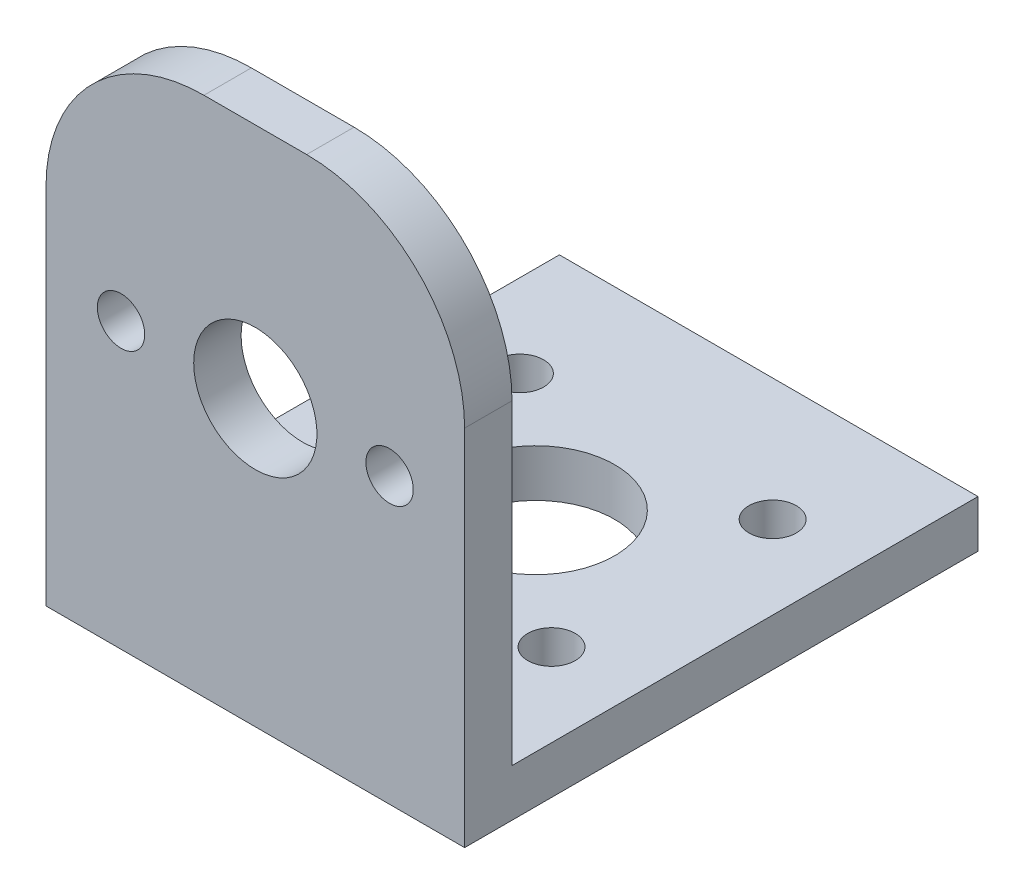
ISO-10303-21;
HEADER;
FILE_DESCRIPTION(('STEP AP214'),'2;1');
FILE_NAME('part.step','',(''),(''),'','','');
FILE_SCHEMA(('AUTOMOTIVE_DESIGN { 1 0 10303 214 1 1 1 1 }'));
ENDSEC;
DATA;
#1=APPLICATION_CONTEXT('core data for automotive mechanical design processes');
#2=APPLICATION_PROTOCOL_DEFINITION('international standard','automotive_design',2000,#1);
#3=PRODUCT_CONTEXT('',#1,'mechanical');
#4=PRODUCT('Part','Part','',(#3));
#5=PRODUCT_RELATED_PRODUCT_CATEGORY('part','',(#4));
#6=PRODUCT_DEFINITION_FORMATION('','',#4);
#7=PRODUCT_DEFINITION_CONTEXT('part definition',#1,'design');
#8=PRODUCT_DEFINITION('design','',#6,#7);
#9=PRODUCT_DEFINITION_SHAPE('','',#8);
#10=(LENGTH_UNIT() NAMED_UNIT(*) SI_UNIT(.MILLI.,.METRE.));
#11=(NAMED_UNIT(*) PLANE_ANGLE_UNIT() SI_UNIT($,.RADIAN.));
#12=(NAMED_UNIT(*) SI_UNIT($,.STERADIAN.) SOLID_ANGLE_UNIT());
#13=UNCERTAINTY_MEASURE_WITH_UNIT(LENGTH_MEASURE(1.E-05),#10,'distance_accuracy_value','');
#14=(GEOMETRIC_REPRESENTATION_CONTEXT(3) GLOBAL_UNCERTAINTY_ASSIGNED_CONTEXT((#13)) GLOBAL_UNIT_ASSIGNED_CONTEXT((#10,
#11,#12)) REPRESENTATION_CONTEXT('',''));
#15=CARTESIAN_POINT('',(0.,0.,0.));
#16=DIRECTION('',(0.,0.,1.));
#17=DIRECTION('',(1.,0.,0.));
#18=AXIS2_PLACEMENT_3D('',#15,#16,#17);
#19=CARTESIAN_POINT('',(26.5,30.,0.));
#20=DIRECTION('',(0.,0.,1.));
#21=DIRECTION('',(1.,0.,0.));
#22=AXIS2_PLACEMENT_3D('',#19,#20,#21);
#23=PLANE('',#22);
#24=CARTESIAN_POINT('',(21.75,15.,0.));
#25=DIRECTION('',(0.,0.,-1.));
#26=DIRECTION('',(-1.,0.,0.));
#27=AXIS2_PLACEMENT_3D('',#24,#25,#26);
#28=CIRCLE('',#27,1.5);
#29=CARTESIAN_POINT('',(20.25,15.,0.));
#30=VERTEX_POINT('',#29);
#31=EDGE_CURVE('E169',#30,#30,#28,.F.);
#32=ORIENTED_EDGE('',*,*,#31,.T.);
#33=EDGE_LOOP('',(#32));
#34=FACE_BOUND('',#33,.T.);
#35=CARTESIAN_POINT('',(13.25,15.,0.));
#36=DIRECTION('',(0.,0.,-1.));
#37=DIRECTION('',(-1.,0.,0.));
#38=AXIS2_PLACEMENT_3D('',#35,#36,#37);
#39=CIRCLE('',#38,3.9);
#40=CARTESIAN_POINT('',(9.35,15.,0.));
#41=VERTEX_POINT('',#40);
#42=EDGE_CURVE('E155',#41,#41,#39,.T.);
#43=ORIENTED_EDGE('',*,*,#42,.F.);
#44=EDGE_LOOP('',(#43));
#45=FACE_BOUND('',#44,.T.);
#46=CARTESIAN_POINT('',(4.75,15.,0.));
#47=DIRECTION('',(0.,0.,-1.));
#48=DIRECTION('',(-1.,0.,0.));
#49=AXIS2_PLACEMENT_3D('',#46,#47,#48);
#50=CIRCLE('',#49,1.5);
#51=CARTESIAN_POINT('',(3.25,15.,0.));
#52=VERTEX_POINT('',#51);
#53=EDGE_CURVE('E176',#52,#52,#50,.T.);
#54=ORIENTED_EDGE('',*,*,#53,.F.);
#55=EDGE_LOOP('',(#54));
#56=FACE_BOUND('',#55,.T.);
#57=DIRECTION('',(0.,1.,0.));
#58=VECTOR('',#57,1.);
#59=CARTESIAN_POINT('',(0.,30.,0.));
#60=LINE('',#59,#58);
#61=CARTESIAN_POINT('',(0.,0.,0.));
#62=VERTEX_POINT('',#61);
#63=CARTESIAN_POINT('',(0.,20.,0.));
#64=VERTEX_POINT('',#63);
#65=EDGE_CURVE('E143',#62,#64,#60,.T.);
#66=ORIENTED_EDGE('',*,*,#65,.T.);
#67=CARTESIAN_POINT('',(10.,20.,0.));
#68=DIRECTION('',(0.,0.,-1.));
#69=DIRECTION('',(-1.,0.,0.));
#70=AXIS2_PLACEMENT_3D('',#67,#68,#69);
#71=CIRCLE('',#70,10.);
#72=CARTESIAN_POINT('',(10.0000000000001,30.,0.));
#73=VERTEX_POINT('',#72);
#74=EDGE_CURVE('E60',#73,#64,#71,.F.);
#75=ORIENTED_EDGE('',*,*,#74,.F.);
#76=DIRECTION('',(-1.,0.,0.));
#77=VECTOR('',#76,1.);
#78=CARTESIAN_POINT('',(26.5,30.,0.));
#79=LINE('',#78,#77);
#80=CARTESIAN_POINT('',(16.4999999999999,30.,0.));
#81=VERTEX_POINT('',#80);
#82=EDGE_CURVE('E11',#81,#73,#79,.T.);
#83=ORIENTED_EDGE('',*,*,#82,.F.);
#84=CARTESIAN_POINT('',(16.5,20.,0.));
#85=DIRECTION('',(0.,0.,-1.));
#86=DIRECTION('',(-1.,0.,0.));
#87=AXIS2_PLACEMENT_3D('',#84,#85,#86);
#88=CIRCLE('',#87,10.);
#89=CARTESIAN_POINT('',(26.5,20.,0.));
#90=VERTEX_POINT('',#89);
#91=EDGE_CURVE('E103',#81,#90,#88,.T.);
#92=ORIENTED_EDGE('',*,*,#91,.T.);
#93=DIRECTION('',(0.,1.,0.));
#94=VECTOR('',#93,1.);
#95=CARTESIAN_POINT('',(26.5,30.,0.));
#96=LINE('',#95,#94);
#97=CARTESIAN_POINT('',(26.5,0.,0.));
#98=VERTEX_POINT('',#97);
#99=EDGE_CURVE('E136',#98,#90,#96,.T.);
#100=ORIENTED_EDGE('',*,*,#99,.F.);
#101=DIRECTION('',(-1.,0.,0.));
#102=VECTOR('',#101,1.);
#103=CARTESIAN_POINT('',(26.5,0.,0.));
#104=LINE('',#103,#102);
#105=EDGE_CURVE('E130',#98,#62,#104,.T.);
#106=ORIENTED_EDGE('',*,*,#105,.T.);
#107=EDGE_LOOP('',(#66,#75,#83,#92,#100,#106));
#108=FACE_BOUND('',#107,.T.);
#109=ADVANCED_FACE('F38',(#34,#45,#56,#108),#23,.F.);
#110=CARTESIAN_POINT('',(26.5,-3.,3.));
#111=DIRECTION('',(0.,0.,-1.));
#112=DIRECTION('',(-1.,0.,0.));
#113=AXIS2_PLACEMENT_3D('',#110,#111,#112);
#114=PLANE('',#113);
#115=CARTESIAN_POINT('',(21.75,15.,3.));
#116=DIRECTION('',(0.,0.,-1.));
#117=DIRECTION('',(-1.,0.,0.));
#118=AXIS2_PLACEMENT_3D('',#115,#116,#117);
#119=CIRCLE('',#118,1.5);
#120=CARTESIAN_POINT('',(20.25,15.,3.));
#121=VERTEX_POINT('',#120);
#122=EDGE_CURVE('E173',#121,#121,#119,.F.);
#123=ORIENTED_EDGE('',*,*,#122,.F.);
#124=EDGE_LOOP('',(#123));
#125=FACE_BOUND('',#124,.T.);
#126=CARTESIAN_POINT('',(13.25,15.,3.));
#127=DIRECTION('',(0.,0.,-1.));
#128=DIRECTION('',(-1.,0.,0.));
#129=AXIS2_PLACEMENT_3D('',#126,#127,#128);
#130=CIRCLE('',#129,3.9);
#131=CARTESIAN_POINT('',(9.35,15.,3.));
#132=VERTEX_POINT('',#131);
#133=EDGE_CURVE('E146',#132,#132,#130,.T.);
#134=ORIENTED_EDGE('',*,*,#133,.T.);
#135=EDGE_LOOP('',(#134));
#136=FACE_BOUND('',#135,.T.);
#137=CARTESIAN_POINT('',(4.75,15.,3.));
#138=DIRECTION('',(0.,0.,-1.));
#139=DIRECTION('',(-1.,0.,0.));
#140=AXIS2_PLACEMENT_3D('',#137,#138,#139);
#141=CIRCLE('',#140,1.5);
#142=CARTESIAN_POINT('',(3.25,15.,3.));
#143=VERTEX_POINT('',#142);
#144=EDGE_CURVE('E158',#143,#143,#141,.T.);
#145=ORIENTED_EDGE('',*,*,#144,.T.);
#146=EDGE_LOOP('',(#145));
#147=FACE_BOUND('',#146,.T.);
#148=DIRECTION('',(-1.,0.,0.));
#149=VECTOR('',#148,1.);
#150=CARTESIAN_POINT('',(26.5,30.,3.));
#151=LINE('',#150,#149);
#152=CARTESIAN_POINT('',(16.4999999999999,30.,3.));
#153=VERTEX_POINT('',#152);
#154=CARTESIAN_POINT('',(10.0000000000001,30.,3.));
#155=VERTEX_POINT('',#154);
#156=EDGE_CURVE('E45',#153,#155,#151,.T.);
#157=ORIENTED_EDGE('',*,*,#156,.T.);
#158=CARTESIAN_POINT('',(10.,20.,3.));
#159=DIRECTION('',(0.,0.,-1.));
#160=DIRECTION('',(-1.,0.,0.));
#161=AXIS2_PLACEMENT_3D('',#158,#159,#160);
#162=CIRCLE('',#161,10.);
#163=CARTESIAN_POINT('',(0.,20.,3.));
#164=VERTEX_POINT('',#163);
#165=EDGE_CURVE('E163',#155,#164,#162,.F.);
#166=ORIENTED_EDGE('',*,*,#165,.T.);
#167=DIRECTION('',(0.,-1.,0.));
#168=VECTOR('',#167,1.);
#169=CARTESIAN_POINT('',(0.,-3.,3.));
#170=LINE('',#169,#168);
#171=CARTESIAN_POINT('',(0.,-3.,3.));
#172=VERTEX_POINT('',#171);
#173=EDGE_CURVE('E141',#164,#172,#170,.T.);
#174=ORIENTED_EDGE('',*,*,#173,.T.);
#175=DIRECTION('',(-1.,0.,0.));
#176=VECTOR('',#175,1.);
#177=CARTESIAN_POINT('',(26.5,-3.,3.));
#178=LINE('',#177,#176);
#179=CARTESIAN_POINT('',(26.5,-3.,3.));
#180=VERTEX_POINT('',#179);
#181=EDGE_CURVE('E120',#180,#172,#178,.T.);
#182=ORIENTED_EDGE('',*,*,#181,.F.);
#183=DIRECTION('',(0.,-1.,0.));
#184=VECTOR('',#183,1.);
#185=CARTESIAN_POINT('',(26.5,-3.,3.));
#186=LINE('',#185,#184);
#187=CARTESIAN_POINT('',(26.5,20.,3.));
#188=VERTEX_POINT('',#187);
#189=EDGE_CURVE('E115',#188,#180,#186,.T.);
#190=ORIENTED_EDGE('',*,*,#189,.F.);
#191=CARTESIAN_POINT('',(16.5,20.,3.));
#192=DIRECTION('',(0.,0.,-1.));
#193=DIRECTION('',(-1.,0.,0.));
#194=AXIS2_PLACEMENT_3D('',#191,#192,#193);
#195=CIRCLE('',#194,10.);
#196=EDGE_CURVE('E52',#153,#188,#195,.T.);
#197=ORIENTED_EDGE('',*,*,#196,.F.);
#198=EDGE_LOOP('',(#157,#166,#174,#182,#190,#197));
#199=FACE_BOUND('',#198,.T.);
#200=ADVANCED_FACE('F112',(#125,#136,#147,#199),#114,.F.);
#201=CARTESIAN_POINT('',(26.5,0.,0.));
#202=DIRECTION('',(-1.,0.,0.));
#203=DIRECTION('',(0.,0.,1.));
#204=AXIS2_PLACEMENT_3D('',#201,#202,#203);
#205=PLANE('',#204);
#206=DIRECTION('',(0.,0.,-1.));
#207=VECTOR('',#206,1.);
#208=CARTESIAN_POINT('',(26.5,20.,3.));
#209=LINE('',#208,#207);
#210=EDGE_CURVE('E107',#188,#90,#209,.T.);
#211=ORIENTED_EDGE('',*,*,#210,.F.);
#212=ORIENTED_EDGE('',*,*,#189,.T.);
#213=DIRECTION('',(0.,0.,-1.));
#214=VECTOR('',#213,1.);
#215=CARTESIAN_POINT('',(26.5,-3.,3.));
#216=LINE('',#215,#214);
#217=CARTESIAN_POINT('',(26.5,-3.,-29.5));
#218=VERTEX_POINT('',#217);
#219=EDGE_CURVE('E150',#180,#218,#216,.T.);
#220=ORIENTED_EDGE('',*,*,#219,.T.);
#221=DIRECTION('',(0.,1.,0.));
#222=VECTOR('',#221,1.);
#223=CARTESIAN_POINT('',(26.5,-3.,-29.5));
#224=LINE('',#223,#222);
#225=CARTESIAN_POINT('',(26.5,0.,-29.5));
#226=VERTEX_POINT('',#225);
#227=EDGE_CURVE('E148',#218,#226,#224,.T.);
#228=ORIENTED_EDGE('',*,*,#227,.T.);
#229=DIRECTION('',(0.,0.,1.));
#230=VECTOR('',#229,1.);
#231=CARTESIAN_POINT('',(26.5,0.,-29.5));
#232=LINE('',#231,#230);
#233=EDGE_CURVE('E133',#226,#98,#232,.T.);
#234=ORIENTED_EDGE('',*,*,#233,.T.);
#235=ORIENTED_EDGE('',*,*,#99,.T.);
#236=EDGE_LOOP('',(#211,#212,#220,#228,#234,#235));
#237=FACE_BOUND('',#236,.T.);
#238=ADVANCED_FACE('F241',(#237),#205,.F.);
#239=CARTESIAN_POINT('',(26.5,30.,3.));
#240=DIRECTION('',(0.,-1.,0.));
#241=DIRECTION('',(0.,0.,-1.));
#242=AXIS2_PLACEMENT_3D('',#239,#240,#241);
#243=PLANE('',#242);
#244=ORIENTED_EDGE('',*,*,#82,.T.);
#245=DIRECTION('',(0.,0.,-1.));
#246=VECTOR('',#245,1.);
#247=CARTESIAN_POINT('',(10.0000000000001,30.,3.));
#248=LINE('',#247,#246);
#249=EDGE_CURVE('E119',#155,#73,#248,.T.);
#250=ORIENTED_EDGE('',*,*,#249,.F.);
#251=ORIENTED_EDGE('',*,*,#156,.F.);
#252=DIRECTION('',(0.,0.,-1.));
#253=VECTOR('',#252,1.);
#254=CARTESIAN_POINT('',(16.4999999999999,30.,3.));
#255=LINE('',#254,#253);
#256=EDGE_CURVE('E100',#153,#81,#255,.T.);
#257=ORIENTED_EDGE('',*,*,#256,.T.);
#258=EDGE_LOOP('',(#244,#250,#251,#257));
#259=FACE_BOUND('',#258,.T.);
#260=ADVANCED_FACE('F118',(#259),#243,.F.);
#261=CARTESIAN_POINT('',(26.5,-3.,3.));
#262=DIRECTION('',(0.,1.,0.));
#263=DIRECTION('',(0.,0.,1.));
#264=AXIS2_PLACEMENT_3D('',#261,#262,#263);
#265=PLANE('',#264);
#266=CARTESIAN_POINT('',(5.25000000000001,-3.,-7.75));
#267=DIRECTION('',(0.,1.,0.));
#268=DIRECTION('',(0.,0.,-1.));
#269=AXIS2_PLACEMENT_3D('',#266,#267,#268);
#270=CIRCLE('',#269,1.50000000000002);
#271=CARTESIAN_POINT('',(5.25000000000001,-3.,-9.25000000000002));
#272=VERTEX_POINT('',#271);
#273=EDGE_CURVE('E187',#272,#272,#270,.T.);
#274=ORIENTED_EDGE('',*,*,#273,.T.);
#275=EDGE_LOOP('',(#274));
#276=FACE_BOUND('',#275,.T.);
#277=CARTESIAN_POINT('',(5.25,-3.,-21.75));
#278=DIRECTION('',(0.,1.,0.));
#279=DIRECTION('',(0.,0.,-1.));
#280=AXIS2_PLACEMENT_3D('',#277,#278,#279);
#281=CIRCLE('',#280,1.50000000000001);
#282=CARTESIAN_POINT('',(5.25,-3.,-23.25));
#283=VERTEX_POINT('',#282);
#284=EDGE_CURVE('E193',#283,#283,#281,.T.);
#285=ORIENTED_EDGE('',*,*,#284,.T.);
#286=EDGE_LOOP('',(#285));
#287=FACE_BOUND('',#286,.T.);
#288=CARTESIAN_POINT('',(21.25,-3.,-7.75));
#289=DIRECTION('',(0.,1.,0.));
#290=DIRECTION('',(0.,0.,1.));
#291=AXIS2_PLACEMENT_3D('',#288,#289,#290);
#292=CIRCLE('',#291,1.5);
#293=CARTESIAN_POINT('',(21.25,-3.,-6.25));
#294=VERTEX_POINT('',#293);
#295=EDGE_CURVE('E199',#294,#294,#292,.T.);
#296=ORIENTED_EDGE('',*,*,#295,.T.);
#297=EDGE_LOOP('',(#296));
#298=FACE_BOUND('',#297,.T.);
#299=CARTESIAN_POINT('',(21.25,-3.,-21.75));
#300=DIRECTION('',(0.,1.,0.));
#301=DIRECTION('',(0.,0.,1.));
#302=AXIS2_PLACEMENT_3D('',#299,#300,#301);
#303=CIRCLE('',#302,1.5);
#304=CARTESIAN_POINT('',(21.25,-3.,-20.25));
#305=VERTEX_POINT('',#304);
#306=EDGE_CURVE('E205',#305,#305,#303,.T.);
#307=ORIENTED_EDGE('',*,*,#306,.T.);
#308=EDGE_LOOP('',(#307));
#309=FACE_BOUND('',#308,.T.);
#310=CARTESIAN_POINT('',(13.25,-3.,-14.75));
#311=DIRECTION('',(0.,1.,0.));
#312=DIRECTION('',(0.,0.,1.));
#313=AXIS2_PLACEMENT_3D('',#310,#311,#312);
#314=CIRCLE('',#313,5.);
#315=CARTESIAN_POINT('',(13.25,-3.,-9.75000000000001));
#316=VERTEX_POINT('',#315);
#317=EDGE_CURVE('E166',#316,#316,#314,.T.);
#318=ORIENTED_EDGE('',*,*,#317,.T.);
#319=EDGE_LOOP('',(#318));
#320=FACE_BOUND('',#319,.T.);
#321=DIRECTION('',(0.,0.,-1.));
#322=VECTOR('',#321,1.);
#323=CARTESIAN_POINT('',(0.,-3.,3.));
#324=LINE('',#323,#322);
#325=CARTESIAN_POINT('',(0.,-3.,-29.5));
#326=VERTEX_POINT('',#325);
#327=EDGE_CURVE('E139',#172,#326,#324,.T.);
#328=ORIENTED_EDGE('',*,*,#327,.T.);
#329=DIRECTION('',(-1.,0.,0.));
#330=VECTOR('',#329,1.);
#331=CARTESIAN_POINT('',(26.5,-3.,-29.5));
#332=LINE('',#331,#330);
#333=EDGE_CURVE('E122',#218,#326,#332,.T.);
#334=ORIENTED_EDGE('',*,*,#333,.F.);
#335=ORIENTED_EDGE('',*,*,#219,.F.);
#336=ORIENTED_EDGE('',*,*,#181,.T.);
#337=EDGE_LOOP('',(#328,#334,#335,#336));
#338=FACE_BOUND('',#337,.T.);
#339=ADVANCED_FACE('F236',(#276,#287,#298,#309,#320,#338),#265,.F.);
#340=CARTESIAN_POINT('',(26.5,-3.,-29.5));
#341=DIRECTION('',(0.,0.,1.));
#342=DIRECTION('',(1.,0.,0.));
#343=AXIS2_PLACEMENT_3D('',#340,#341,#342);
#344=PLANE('',#343);
#345=DIRECTION('',(0.,1.,0.));
#346=VECTOR('',#345,1.);
#347=CARTESIAN_POINT('',(0.,-3.,-29.5));
#348=LINE('',#347,#346);
#349=CARTESIAN_POINT('',(0.,0.,-29.5));
#350=VERTEX_POINT('',#349);
#351=EDGE_CURVE('E137',#326,#350,#348,.T.);
#352=ORIENTED_EDGE('',*,*,#351,.T.);
#353=DIRECTION('',(-1.,0.,0.));
#354=VECTOR('',#353,1.);
#355=CARTESIAN_POINT('',(26.5,0.,-29.5));
#356=LINE('',#355,#354);
#357=EDGE_CURVE('E127',#226,#350,#356,.T.);
#358=ORIENTED_EDGE('',*,*,#357,.F.);
#359=ORIENTED_EDGE('',*,*,#227,.F.);
#360=ORIENTED_EDGE('',*,*,#333,.T.);
#361=EDGE_LOOP('',(#352,#358,#359,#360));
#362=FACE_BOUND('',#361,.T.);
#363=ADVANCED_FACE('F217',(#362),#344,.F.);
#364=CARTESIAN_POINT('',(26.5,0.,-29.5));
#365=DIRECTION('',(0.,-1.,0.));
#366=DIRECTION('',(0.,0.,-1.));
#367=AXIS2_PLACEMENT_3D('',#364,#365,#366);
#368=PLANE('',#367);
#369=CARTESIAN_POINT('',(5.25000000000001,0.,-7.75));
#370=DIRECTION('',(0.,1.,0.));
#371=DIRECTION('',(0.,0.,-1.));
#372=AXIS2_PLACEMENT_3D('',#369,#370,#371);
#373=CIRCLE('',#372,1.50000000000002);
#374=CARTESIAN_POINT('',(5.25000000000001,0.,-9.25000000000002));
#375=VERTEX_POINT('',#374);
#376=EDGE_CURVE('E190',#375,#375,#373,.T.);
#377=ORIENTED_EDGE('',*,*,#376,.F.);
#378=EDGE_LOOP('',(#377));
#379=FACE_BOUND('',#378,.T.);
#380=CARTESIAN_POINT('',(5.25,0.,-21.75));
#381=DIRECTION('',(0.,1.,0.));
#382=DIRECTION('',(0.,0.,-1.));
#383=AXIS2_PLACEMENT_3D('',#380,#381,#382);
#384=CIRCLE('',#383,1.50000000000001);
#385=CARTESIAN_POINT('',(5.25,0.,-23.25));
#386=VERTEX_POINT('',#385);
#387=EDGE_CURVE('E196',#386,#386,#384,.T.);
#388=ORIENTED_EDGE('',*,*,#387,.F.);
#389=EDGE_LOOP('',(#388));
#390=FACE_BOUND('',#389,.T.);
#391=CARTESIAN_POINT('',(21.25,0.,-7.75));
#392=DIRECTION('',(0.,1.,0.));
#393=DIRECTION('',(0.,0.,1.));
#394=AXIS2_PLACEMENT_3D('',#391,#392,#393);
#395=CIRCLE('',#394,1.5);
#396=CARTESIAN_POINT('',(21.25,0.,-6.25));
#397=VERTEX_POINT('',#396);
#398=EDGE_CURVE('E202',#397,#397,#395,.T.);
#399=ORIENTED_EDGE('',*,*,#398,.F.);
#400=EDGE_LOOP('',(#399));
#401=FACE_BOUND('',#400,.T.);
#402=CARTESIAN_POINT('',(21.25,0.,-21.75));
#403=DIRECTION('',(0.,1.,0.));
#404=DIRECTION('',(0.,0.,1.));
#405=AXIS2_PLACEMENT_3D('',#402,#403,#404);
#406=CIRCLE('',#405,1.5);
#407=CARTESIAN_POINT('',(21.25,0.,-20.25));
#408=VERTEX_POINT('',#407);
#409=EDGE_CURVE('E184',#408,#408,#406,.T.);
#410=ORIENTED_EDGE('',*,*,#409,.F.);
#411=EDGE_LOOP('',(#410));
#412=FACE_BOUND('',#411,.T.);
#413=CARTESIAN_POINT('',(13.25,0.,-14.75));
#414=DIRECTION('',(0.,1.,0.));
#415=DIRECTION('',(0.,0.,1.));
#416=AXIS2_PLACEMENT_3D('',#413,#414,#415);
#417=CIRCLE('',#416,5.);
#418=CARTESIAN_POINT('',(13.25,0.,-9.75000000000001));
#419=VERTEX_POINT('',#418);
#420=EDGE_CURVE('E181',#419,#419,#417,.T.);
#421=ORIENTED_EDGE('',*,*,#420,.F.);
#422=EDGE_LOOP('',(#421));
#423=FACE_BOUND('',#422,.T.);
#424=DIRECTION('',(0.,0.,1.));
#425=VECTOR('',#424,1.);
#426=CARTESIAN_POINT('',(0.,0.,-29.5));
#427=LINE('',#426,#425);
#428=EDGE_CURVE('E134',#350,#62,#427,.T.);
#429=ORIENTED_EDGE('',*,*,#428,.T.);
#430=ORIENTED_EDGE('',*,*,#105,.F.);
#431=ORIENTED_EDGE('',*,*,#233,.F.);
#432=ORIENTED_EDGE('',*,*,#357,.T.);
#433=EDGE_LOOP('',(#429,#430,#431,#432));
#434=FACE_BOUND('',#433,.T.);
#435=ADVANCED_FACE('F213',(#379,#390,#401,#412,#423,#434),#368,.F.);
#436=CARTESIAN_POINT('',(0.,0.,0.));
#437=DIRECTION('',(-1.,0.,0.));
#438=DIRECTION('',(0.,0.,1.));
#439=AXIS2_PLACEMENT_3D('',#436,#437,#438);
#440=PLANE('',#439);
#441=DIRECTION('',(0.,0.,-1.));
#442=VECTOR('',#441,1.);
#443=CARTESIAN_POINT('',(0.,20.,3.));
#444=LINE('',#443,#442);
#445=EDGE_CURVE('E162',#164,#64,#444,.T.);
#446=ORIENTED_EDGE('',*,*,#445,.T.);
#447=ORIENTED_EDGE('',*,*,#65,.F.);
#448=ORIENTED_EDGE('',*,*,#428,.F.);
#449=ORIENTED_EDGE('',*,*,#351,.F.);
#450=ORIENTED_EDGE('',*,*,#327,.F.);
#451=ORIENTED_EDGE('',*,*,#173,.F.);
#452=EDGE_LOOP('',(#446,#447,#448,#449,#450,#451));
#453=FACE_BOUND('',#452,.T.);
#454=ADVANCED_FACE('F216',(#453),#440,.T.);
#455=CARTESIAN_POINT('',(10.,20.,3.));
#456=DIRECTION('',(0.,0.,-1.));
#457=DIRECTION('',(-1.,0.,0.));
#458=AXIS2_PLACEMENT_3D('',#455,#456,#457);
#459=CYLINDRICAL_SURFACE('',#458,10.);
#460=ORIENTED_EDGE('',*,*,#74,.T.);
#461=ORIENTED_EDGE('',*,*,#445,.F.);
#462=ORIENTED_EDGE('',*,*,#165,.F.);
#463=ORIENTED_EDGE('',*,*,#249,.T.);
#464=EDGE_LOOP('',(#460,#461,#462,#463));
#465=FACE_BOUND('',#464,.T.);
#466=ADVANCED_FACE('F233',(#465),#459,.T.);
#467=CARTESIAN_POINT('',(16.5,20.,3.));
#468=DIRECTION('',(0.,0.,-1.));
#469=DIRECTION('',(-1.,0.,0.));
#470=AXIS2_PLACEMENT_3D('',#467,#468,#469);
#471=CYLINDRICAL_SURFACE('',#470,10.);
#472=ORIENTED_EDGE('',*,*,#91,.F.);
#473=ORIENTED_EDGE('',*,*,#256,.F.);
#474=ORIENTED_EDGE('',*,*,#196,.T.);
#475=ORIENTED_EDGE('',*,*,#210,.T.);
#476=EDGE_LOOP('',(#472,#473,#474,#475));
#477=FACE_BOUND('',#476,.T.);
#478=ADVANCED_FACE('F101',(#477),#471,.T.);
#479=CARTESIAN_POINT('',(13.25,15.,3.));
#480=DIRECTION('',(0.,0.,-1.));
#481=DIRECTION('',(-1.,0.,0.));
#482=AXIS2_PLACEMENT_3D('',#479,#480,#481);
#483=CYLINDRICAL_SURFACE('',#482,3.9);
#484=ORIENTED_EDGE('',*,*,#133,.F.);
#485=EDGE_LOOP('',(#484));
#486=FACE_BOUND('',#485,.T.);
#487=ORIENTED_EDGE('',*,*,#42,.T.);
#488=EDGE_LOOP('',(#487));
#489=FACE_BOUND('',#488,.T.);
#490=ADVANCED_FACE('F265',(#486,#489),#483,.F.);
#491=CARTESIAN_POINT('',(4.75,15.,3.));
#492=DIRECTION('',(0.,0.,-1.));
#493=DIRECTION('',(-1.,0.,0.));
#494=AXIS2_PLACEMENT_3D('',#491,#492,#493);
#495=CYLINDRICAL_SURFACE('',#494,1.5);
#496=ORIENTED_EDGE('',*,*,#144,.F.);
#497=EDGE_LOOP('',(#496));
#498=FACE_BOUND('',#497,.T.);
#499=ORIENTED_EDGE('',*,*,#53,.T.);
#500=EDGE_LOOP('',(#499));
#501=FACE_BOUND('',#500,.T.);
#502=ADVANCED_FACE('F262',(#498,#501),#495,.F.);
#503=CARTESIAN_POINT('',(21.75,15.,3.));
#504=DIRECTION('',(0.,0.,-1.));
#505=DIRECTION('',(-1.,0.,0.));
#506=AXIS2_PLACEMENT_3D('',#503,#504,#505);
#507=CYLINDRICAL_SURFACE('',#506,1.5);
#508=ORIENTED_EDGE('',*,*,#122,.T.);
#509=EDGE_LOOP('',(#508));
#510=FACE_BOUND('',#509,.T.);
#511=ORIENTED_EDGE('',*,*,#31,.F.);
#512=EDGE_LOOP('',(#511));
#513=FACE_BOUND('',#512,.T.);
#514=ADVANCED_FACE('F264',(#510,#513),#507,.F.);
#515=CARTESIAN_POINT('',(13.25,-3.,-14.75));
#516=DIRECTION('',(0.,1.,0.));
#517=DIRECTION('',(0.,0.,1.));
#518=AXIS2_PLACEMENT_3D('',#515,#516,#517);
#519=CYLINDRICAL_SURFACE('',#518,5.);
#520=ORIENTED_EDGE('',*,*,#317,.F.);
#521=EDGE_LOOP('',(#520));
#522=FACE_BOUND('',#521,.T.);
#523=ORIENTED_EDGE('',*,*,#420,.T.);
#524=EDGE_LOOP('',(#523));
#525=FACE_BOUND('',#524,.T.);
#526=ADVANCED_FACE('F272',(#522,#525),#519,.F.);
#527=CARTESIAN_POINT('',(21.25,-3.,-21.75));
#528=DIRECTION('',(0.,1.,0.));
#529=DIRECTION('',(0.,0.,1.));
#530=AXIS2_PLACEMENT_3D('',#527,#528,#529);
#531=CYLINDRICAL_SURFACE('',#530,1.5);
#532=ORIENTED_EDGE('',*,*,#306,.F.);
#533=EDGE_LOOP('',(#532));
#534=FACE_BOUND('',#533,.T.);
#535=ORIENTED_EDGE('',*,*,#409,.T.);
#536=EDGE_LOOP('',(#535));
#537=FACE_BOUND('',#536,.T.);
#538=ADVANCED_FACE('F211',(#534,#537),#531,.F.);
#539=CARTESIAN_POINT('',(21.25,-3.,-7.75));
#540=DIRECTION('',(0.,1.,0.));
#541=DIRECTION('',(0.,0.,1.));
#542=AXIS2_PLACEMENT_3D('',#539,#540,#541);
#543=CYLINDRICAL_SURFACE('',#542,1.5);
#544=ORIENTED_EDGE('',*,*,#295,.F.);
#545=EDGE_LOOP('',(#544));
#546=FACE_BOUND('',#545,.T.);
#547=ORIENTED_EDGE('',*,*,#398,.T.);
#548=EDGE_LOOP('',(#547));
#549=FACE_BOUND('',#548,.T.);
#550=ADVANCED_FACE('F310',(#546,#549),#543,.F.);
#551=CARTESIAN_POINT('',(5.25,-3.,-21.75));
#552=DIRECTION('',(0.,1.,0.));
#553=DIRECTION('',(0.,0.,1.));
#554=AXIS2_PLACEMENT_3D('',#551,#552,#553);
#555=CYLINDRICAL_SURFACE('',#554,1.50000000000001);
#556=ORIENTED_EDGE('',*,*,#284,.F.);
#557=EDGE_LOOP('',(#556));
#558=FACE_BOUND('',#557,.T.);
#559=ORIENTED_EDGE('',*,*,#387,.T.);
#560=EDGE_LOOP('',(#559));
#561=FACE_BOUND('',#560,.T.);
#562=ADVANCED_FACE('F316',(#558,#561),#555,.F.);
#563=CARTESIAN_POINT('',(5.25000000000001,-3.,-7.75));
#564=DIRECTION('',(0.,1.,0.));
#565=DIRECTION('',(0.,0.,1.));
#566=AXIS2_PLACEMENT_3D('',#563,#564,#565);
#567=CYLINDRICAL_SURFACE('',#566,1.50000000000002);
#568=ORIENTED_EDGE('',*,*,#273,.F.);
#569=EDGE_LOOP('',(#568));
#570=FACE_BOUND('',#569,.T.);
#571=ORIENTED_EDGE('',*,*,#376,.T.);
#572=EDGE_LOOP('',(#571));
#573=FACE_BOUND('',#572,.T.);
#574=ADVANCED_FACE('F321',(#570,#573),#567,.F.);
#575=CLOSED_SHELL('',(#109,#200,#238,#260,#339,#363,#435,#454,#466,#478,#490,#502,#514,#526,
#538,#550,#562,#574));
#576=MANIFOLD_SOLID_BREP('B2',#575);
#577=ADVANCED_BREP_SHAPE_REPRESENTATION('',(#18,#576),#14);
#578=SHAPE_DEFINITION_REPRESENTATION(#9,#577);
ENDSEC;
END-ISO-10303-21;
